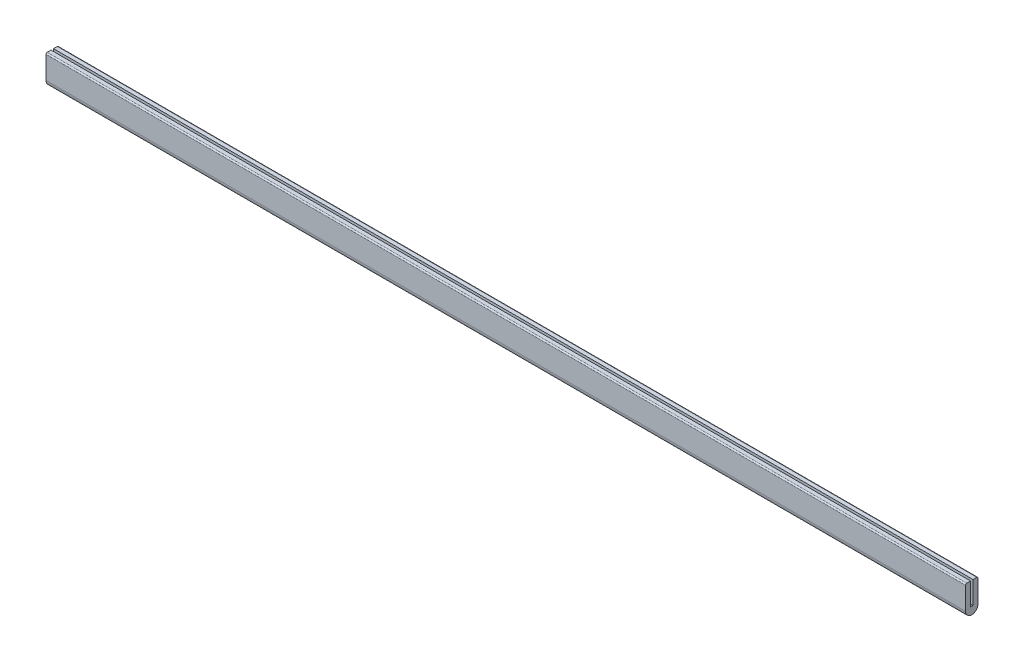
ISO-10303-21;
HEADER;
FILE_DESCRIPTION(('STEP AP214'),'2;1');
FILE_NAME('part.step','',(''),(''),'','','');
FILE_SCHEMA(('AUTOMOTIVE_DESIGN { 1 0 10303 214 1 1 1 1 }'));
ENDSEC;
DATA;
#1=APPLICATION_CONTEXT('core data for automotive mechanical design processes');
#2=APPLICATION_PROTOCOL_DEFINITION('international standard','automotive_design',2000,#1);
#3=PRODUCT_CONTEXT('',#1,'mechanical');
#4=PRODUCT('Part','Part','',(#3));
#5=PRODUCT_RELATED_PRODUCT_CATEGORY('part','',(#4));
#6=PRODUCT_DEFINITION_FORMATION('','',#4);
#7=PRODUCT_DEFINITION_CONTEXT('part definition',#1,'design');
#8=PRODUCT_DEFINITION('design','',#6,#7);
#9=PRODUCT_DEFINITION_SHAPE('','',#8);
#10=(LENGTH_UNIT() NAMED_UNIT(*) SI_UNIT(.MILLI.,.METRE.));
#11=(NAMED_UNIT(*) PLANE_ANGLE_UNIT() SI_UNIT($,.RADIAN.));
#12=(NAMED_UNIT(*) SI_UNIT($,.STERADIAN.) SOLID_ANGLE_UNIT());
#13=UNCERTAINTY_MEASURE_WITH_UNIT(LENGTH_MEASURE(1.E-05),#10,'distance_accuracy_value','');
#14=(GEOMETRIC_REPRESENTATION_CONTEXT(3) GLOBAL_UNCERTAINTY_ASSIGNED_CONTEXT((#13)) GLOBAL_UNIT_ASSIGNED_CONTEXT((#10,
#11,#12)) REPRESENTATION_CONTEXT('',''));
#15=CARTESIAN_POINT('',(0.,0.,0.));
#16=DIRECTION('',(0.,0.,1.));
#17=DIRECTION('',(1.,0.,0.));
#18=AXIS2_PLACEMENT_3D('',#15,#16,#17);
#19=CARTESIAN_POINT('',(584.2,28.575,1.5875));
#20=DIRECTION('',(0.,0.,1.));
#21=DIRECTION('',(0.,-1.,0.));
#22=AXIS2_PLACEMENT_3D('',#19,#20,#21);
#23=PLANE('',#22);
#24=DIRECTION('',(0.,1.,0.));
#25=VECTOR('',#24,1.);
#26=CARTESIAN_POINT('',(-584.2,28.575,1.5875));
#27=LINE('',#26,#25);
#28=CARTESIAN_POINT('',(-584.2,0.,1.5875));
#29=VERTEX_POINT('',#28);
#30=CARTESIAN_POINT('',(-584.2,28.575,1.5875));
#31=VERTEX_POINT('',#30);
#32=EDGE_CURVE('E132',#29,#31,#27,.T.);
#33=ORIENTED_EDGE('',*,*,#32,.T.);
#34=DIRECTION('',(-1.,0.,0.));
#35=VECTOR('',#34,1.);
#36=CARTESIAN_POINT('',(584.2,28.575,1.5875));
#37=LINE('',#36,#35);
#38=CARTESIAN_POINT('',(584.2,28.575,1.5875));
#39=VERTEX_POINT('',#38);
#40=EDGE_CURVE('E114',#39,#31,#37,.T.);
#41=ORIENTED_EDGE('',*,*,#40,.F.);
#42=DIRECTION('',(0.,1.,0.));
#43=VECTOR('',#42,1.);
#44=CARTESIAN_POINT('',(584.2,28.575,1.5875));
#45=LINE('',#44,#43);
#46=CARTESIAN_POINT('',(584.2,0.,1.5875));
#47=VERTEX_POINT('',#46);
#48=EDGE_CURVE('E120',#47,#39,#45,.T.);
#49=ORIENTED_EDGE('',*,*,#48,.F.);
#50=DIRECTION('',(-1.,0.,0.));
#51=VECTOR('',#50,1.);
#52=CARTESIAN_POINT('',(584.2,0.,1.5875));
#53=LINE('',#52,#51);
#54=EDGE_CURVE('E175',#47,#29,#53,.T.);
#55=ORIENTED_EDGE('',*,*,#54,.T.);
#56=EDGE_LOOP('',(#33,#41,#49,#55));
#57=FACE_BOUND('',#56,.T.);
#58=ADVANCED_FACE('F32',(#57),#23,.F.);
#59=CARTESIAN_POINT('',(584.2,28.575,1.5875));
#60=DIRECTION('',(0.,-1.,0.));
#61=DIRECTION('',(0.,0.,-1.));
#62=AXIS2_PLACEMENT_3D('',#59,#60,#61);
#63=PLANE('',#62);
#64=DIRECTION('',(0.,0.,1.));
#65=VECTOR('',#64,1.);
#66=CARTESIAN_POINT('',(-584.2,28.575,1.5875));
#67=LINE('',#66,#65);
#68=CARTESIAN_POINT('',(-584.2,28.575,6.34999999999999));
#69=VERTEX_POINT('',#68);
#70=EDGE_CURVE('E189',#31,#69,#67,.T.);
#71=ORIENTED_EDGE('',*,*,#70,.T.);
#72=DIRECTION('',(-1.,0.,0.));
#73=VECTOR('',#72,1.);
#74=CARTESIAN_POINT('',(584.2,28.575,6.34999999999999));
#75=LINE('',#74,#73);
#76=CARTESIAN_POINT('',(584.2,28.575,6.34999999999999));
#77=VERTEX_POINT('',#76);
#78=EDGE_CURVE('E117',#69,#77,#75,.F.);
#79=ORIENTED_EDGE('',*,*,#78,.T.);
#80=DIRECTION('',(0.,0.,1.));
#81=VECTOR('',#80,1.);
#82=CARTESIAN_POINT('',(584.2,28.575,1.5875));
#83=LINE('',#82,#81);
#84=EDGE_CURVE('E109',#39,#77,#83,.T.);
#85=ORIENTED_EDGE('',*,*,#84,.F.);
#86=ORIENTED_EDGE('',*,*,#40,.T.);
#87=EDGE_LOOP('',(#71,#79,#85,#86));
#88=FACE_BOUND('',#87,.T.);
#89=ADVANCED_FACE('F112',(#88),#63,.F.);
#90=CARTESIAN_POINT('',(584.2,28.575,7.93749999999999));
#91=DIRECTION('',(0.,0.,-1.));
#92=DIRECTION('',(0.,1.,0.));
#93=AXIS2_PLACEMENT_3D('',#90,#91,#92);
#94=PLANE('',#93);
#95=DIRECTION('',(0.,-1.,0.));
#96=VECTOR('',#95,1.);
#97=CARTESIAN_POINT('',(584.2,28.575,7.93749999999999));
#98=LINE('',#97,#96);
#99=CARTESIAN_POINT('',(584.2,26.9875,7.93749999999999));
#100=VERTEX_POINT('',#99);
#101=CARTESIAN_POINT('',(584.2,-1.58750000000001,7.9375));
#102=VERTEX_POINT('',#101);
#103=EDGE_CURVE('E119',#100,#102,#98,.T.);
#104=ORIENTED_EDGE('',*,*,#103,.F.);
#105=DIRECTION('',(-1.,0.,0.));
#106=VECTOR('',#105,1.);
#107=CARTESIAN_POINT('',(584.2,26.9875,7.93749999999999));
#108=LINE('',#107,#106);
#109=CARTESIAN_POINT('',(-584.2,26.9875,7.93749999999999));
#110=VERTEX_POINT('',#109);
#111=EDGE_CURVE('E133',#100,#110,#108,.T.);
#112=ORIENTED_EDGE('',*,*,#111,.T.);
#113=DIRECTION('',(0.,-1.,0.));
#114=VECTOR('',#113,1.);
#115=CARTESIAN_POINT('',(-584.2,28.575,7.93749999999999));
#116=LINE('',#115,#114);
#117=CARTESIAN_POINT('',(-584.2,-1.58750000000001,7.9375));
#118=VERTEX_POINT('',#117);
#119=EDGE_CURVE('E188',#110,#118,#116,.T.);
#120=ORIENTED_EDGE('',*,*,#119,.T.);
#121=DIRECTION('',(-1.,0.,0.));
#122=VECTOR('',#121,1.);
#123=CARTESIAN_POINT('',(584.2,-1.58750000000001,7.9375));
#124=LINE('',#123,#122);
#125=EDGE_CURVE('E134',#102,#118,#124,.T.);
#126=ORIENTED_EDGE('',*,*,#125,.F.);
#127=EDGE_LOOP('',(#104,#112,#120,#126));
#128=FACE_BOUND('',#127,.T.);
#129=ADVANCED_FACE('F205',(#128),#94,.F.);
#130=CARTESIAN_POINT('',(584.2,-1.58750000000001,0.));
#131=DIRECTION('',(-1.,0.,0.));
#132=DIRECTION('',(0.,0.,1.));
#133=AXIS2_PLACEMENT_3D('',#130,#131,#132);
#134=CYLINDRICAL_SURFACE('',#133,7.9375);
#135=CARTESIAN_POINT('',(-584.2,-1.58750000000001,0.));
#136=DIRECTION('',(1.,0.,0.));
#137=DIRECTION('',(0.,0.,1.));
#138=AXIS2_PLACEMENT_3D('',#135,#136,#137);
#139=CIRCLE('',#138,7.9375);
#140=CARTESIAN_POINT('',(-584.2,-1.5875,-7.9375));
#141=VERTEX_POINT('',#140);
#142=EDGE_CURVE('E170',#118,#141,#139,.T.);
#143=ORIENTED_EDGE('',*,*,#142,.T.);
#144=DIRECTION('',(-1.,0.,0.));
#145=VECTOR('',#144,1.);
#146=CARTESIAN_POINT('',(584.2,-1.5875,-7.9375));
#147=LINE('',#146,#145);
#148=CARTESIAN_POINT('',(584.2,-1.5875,-7.9375));
#149=VERTEX_POINT('',#148);
#150=EDGE_CURVE('E140',#149,#141,#147,.T.);
#151=ORIENTED_EDGE('',*,*,#150,.F.);
#152=CARTESIAN_POINT('',(584.2,-1.58750000000001,0.));
#153=DIRECTION('',(1.,0.,0.));
#154=DIRECTION('',(0.,0.,1.));
#155=AXIS2_PLACEMENT_3D('',#152,#153,#154);
#156=CIRCLE('',#155,7.9375);
#157=EDGE_CURVE('E199',#102,#149,#156,.T.);
#158=ORIENTED_EDGE('',*,*,#157,.F.);
#159=ORIENTED_EDGE('',*,*,#125,.T.);
#160=EDGE_LOOP('',(#143,#151,#158,#159));
#161=FACE_BOUND('',#160,.T.);
#162=ADVANCED_FACE('F206',(#161),#134,.T.);
#163=CARTESIAN_POINT('',(584.2,28.575,-7.93749999999999));
#164=DIRECTION('',(0.,0.,1.));
#165=DIRECTION('',(0.,-1.,0.));
#166=AXIS2_PLACEMENT_3D('',#163,#164,#165);
#167=PLANE('',#166);
#168=DIRECTION('',(0.,1.,0.));
#169=VECTOR('',#168,1.);
#170=CARTESIAN_POINT('',(-584.2,28.575,-7.93749999999999));
#171=LINE('',#170,#169);
#172=CARTESIAN_POINT('',(-584.2,26.9875,-7.93749999999999));
#173=VERTEX_POINT('',#172);
#174=EDGE_CURVE('E167',#141,#173,#171,.T.);
#175=ORIENTED_EDGE('',*,*,#174,.T.);
#176=DIRECTION('',(-1.,0.,0.));
#177=VECTOR('',#176,1.);
#178=CARTESIAN_POINT('',(584.2,26.9875,-7.93749999999999));
#179=LINE('',#178,#177);
#180=CARTESIAN_POINT('',(584.2,26.9875,-7.93749999999999));
#181=VERTEX_POINT('',#180);
#182=EDGE_CURVE('E11',#173,#181,#179,.F.);
#183=ORIENTED_EDGE('',*,*,#182,.T.);
#184=DIRECTION('',(0.,1.,0.));
#185=VECTOR('',#184,1.);
#186=CARTESIAN_POINT('',(584.2,28.575,-7.93749999999999));
#187=LINE('',#186,#185);
#188=EDGE_CURVE('E184',#149,#181,#187,.T.);
#189=ORIENTED_EDGE('',*,*,#188,.F.);
#190=ORIENTED_EDGE('',*,*,#150,.T.);
#191=EDGE_LOOP('',(#175,#183,#189,#190));
#192=FACE_BOUND('',#191,.T.);
#193=ADVANCED_FACE('F183',(#192),#167,.F.);
#194=CARTESIAN_POINT('',(584.2,28.575,-7.93749999999999));
#195=DIRECTION('',(0.,-1.,0.));
#196=DIRECTION('',(0.,0.,-1.));
#197=AXIS2_PLACEMENT_3D('',#194,#195,#196);
#198=PLANE('',#197);
#199=DIRECTION('',(0.,0.,1.));
#200=VECTOR('',#199,1.);
#201=CARTESIAN_POINT('',(584.2,28.575,-7.93749999999999));
#202=LINE('',#201,#200);
#203=CARTESIAN_POINT('',(584.2,28.575,-6.34999999999999));
#204=VERTEX_POINT('',#203);
#205=CARTESIAN_POINT('',(584.2,28.575,-1.58749999999999));
#206=VERTEX_POINT('',#205);
#207=EDGE_CURVE('E158',#204,#206,#202,.T.);
#208=ORIENTED_EDGE('',*,*,#207,.F.);
#209=DIRECTION('',(-1.,0.,0.));
#210=VECTOR('',#209,1.);
#211=CARTESIAN_POINT('',(584.2,28.575,-6.34999999999999));
#212=LINE('',#211,#210);
#213=CARTESIAN_POINT('',(-584.2,28.575,-6.34999999999999));
#214=VERTEX_POINT('',#213);
#215=EDGE_CURVE('E40',#204,#214,#212,.T.);
#216=ORIENTED_EDGE('',*,*,#215,.T.);
#217=DIRECTION('',(0.,0.,1.));
#218=VECTOR('',#217,1.);
#219=CARTESIAN_POINT('',(-584.2,28.575,-7.93749999999999));
#220=LINE('',#219,#218);
#221=CARTESIAN_POINT('',(-584.2,28.575,-1.58749999999999));
#222=VERTEX_POINT('',#221);
#223=EDGE_CURVE('E156',#214,#222,#220,.T.);
#224=ORIENTED_EDGE('',*,*,#223,.T.);
#225=DIRECTION('',(-1.,0.,0.));
#226=VECTOR('',#225,1.);
#227=CARTESIAN_POINT('',(584.2,28.575,-1.58749999999999));
#228=LINE('',#227,#226);
#229=EDGE_CURVE('E180',#206,#222,#228,.T.);
#230=ORIENTED_EDGE('',*,*,#229,.F.);
#231=EDGE_LOOP('',(#208,#216,#224,#230));
#232=FACE_BOUND('',#231,.T.);
#233=ADVANCED_FACE('F154',(#232),#198,.F.);
#234=CARTESIAN_POINT('',(584.2,28.575,-1.58749999999999));
#235=DIRECTION('',(0.,0.,-1.));
#236=DIRECTION('',(0.,1.,0.));
#237=AXIS2_PLACEMENT_3D('',#234,#235,#236);
#238=PLANE('',#237);
#239=DIRECTION('',(0.,-1.,0.));
#240=VECTOR('',#239,1.);
#241=CARTESIAN_POINT('',(-584.2,28.575,-1.58749999999999));
#242=LINE('',#241,#240);
#243=CARTESIAN_POINT('',(-584.2,0.,-1.5875));
#244=VERTEX_POINT('',#243);
#245=EDGE_CURVE('E166',#222,#244,#242,.T.);
#246=ORIENTED_EDGE('',*,*,#245,.T.);
#247=DIRECTION('',(-1.,0.,0.));
#248=VECTOR('',#247,1.);
#249=CARTESIAN_POINT('',(584.2,0.,-1.5875));
#250=LINE('',#249,#248);
#251=CARTESIAN_POINT('',(584.2,0.,-1.5875));
#252=VERTEX_POINT('',#251);
#253=EDGE_CURVE('E177',#252,#244,#250,.T.);
#254=ORIENTED_EDGE('',*,*,#253,.F.);
#255=DIRECTION('',(0.,-1.,0.));
#256=VECTOR('',#255,1.);
#257=CARTESIAN_POINT('',(584.2,28.575,-1.58749999999999));
#258=LINE('',#257,#256);
#259=EDGE_CURVE('E195',#206,#252,#258,.T.);
#260=ORIENTED_EDGE('',*,*,#259,.F.);
#261=ORIENTED_EDGE('',*,*,#229,.T.);
#262=EDGE_LOOP('',(#246,#254,#260,#261));
#263=FACE_BOUND('',#262,.T.);
#264=ADVANCED_FACE('F234',(#263),#238,.F.);
#265=CARTESIAN_POINT('',(584.2,0.,1.5875));
#266=DIRECTION('',(0.,-1.,0.));
#267=DIRECTION('',(0.,0.,-1.));
#268=AXIS2_PLACEMENT_3D('',#265,#266,#267);
#269=PLANE('',#268);
#270=DIRECTION('',(0.,0.,1.));
#271=VECTOR('',#270,1.);
#272=CARTESIAN_POINT('',(-584.2,0.,1.5875));
#273=LINE('',#272,#271);
#274=EDGE_CURVE('E129',#244,#29,#273,.T.);
#275=ORIENTED_EDGE('',*,*,#274,.T.);
#276=ORIENTED_EDGE('',*,*,#54,.F.);
#277=DIRECTION('',(0.,0.,1.));
#278=VECTOR('',#277,1.);
#279=CARTESIAN_POINT('',(584.2,0.,1.5875));
#280=LINE('',#279,#278);
#281=EDGE_CURVE('E125',#252,#47,#280,.T.);
#282=ORIENTED_EDGE('',*,*,#281,.F.);
#283=ORIENTED_EDGE('',*,*,#253,.T.);
#284=EDGE_LOOP('',(#275,#276,#282,#283));
#285=FACE_BOUND('',#284,.T.);
#286=ADVANCED_FACE('F230',(#285),#269,.F.);
#287=CARTESIAN_POINT('',(584.2,-1.58750000000001,0.));
#288=DIRECTION('',(-1.,0.,0.));
#289=DIRECTION('',(0.,0.,1.));
#290=AXIS2_PLACEMENT_3D('',#287,#288,#289);
#291=PLANE('',#290);
#292=ORIENTED_EDGE('',*,*,#84,.T.);
#293=CARTESIAN_POINT('',(584.2,26.9875,6.34999999999999));
#294=DIRECTION('',(-1.,0.,0.));
#295=DIRECTION('',(0.,0.,1.));
#296=AXIS2_PLACEMENT_3D('',#293,#294,#295);
#297=CIRCLE('',#296,1.5875);
#298=EDGE_CURVE('E149',#77,#100,#297,.F.);
#299=ORIENTED_EDGE('',*,*,#298,.T.);
#300=ORIENTED_EDGE('',*,*,#103,.T.);
#301=ORIENTED_EDGE('',*,*,#157,.T.);
#302=ORIENTED_EDGE('',*,*,#188,.T.);
#303=CARTESIAN_POINT('',(584.2,26.9875,-6.34999999999999));
#304=DIRECTION('',(-1.,0.,0.));
#305=DIRECTION('',(0.,0.,1.));
#306=AXIS2_PLACEMENT_3D('',#303,#304,#305);
#307=CIRCLE('',#306,1.5875);
#308=EDGE_CURVE('E47',#181,#204,#307,.F.);
#309=ORIENTED_EDGE('',*,*,#308,.T.);
#310=ORIENTED_EDGE('',*,*,#207,.T.);
#311=ORIENTED_EDGE('',*,*,#259,.T.);
#312=ORIENTED_EDGE('',*,*,#281,.T.);
#313=ORIENTED_EDGE('',*,*,#48,.T.);
#314=EDGE_LOOP('',(#292,#299,#300,#301,#302,#309,#310,#311,#312,#313));
#315=FACE_BOUND('',#314,.T.);
#316=ADVANCED_FACE('F123',(#315),#291,.F.);
#317=CARTESIAN_POINT('',(-584.2,-1.58750000000001,0.));
#318=DIRECTION('',(-1.,0.,0.));
#319=DIRECTION('',(0.,0.,1.));
#320=AXIS2_PLACEMENT_3D('',#317,#318,#319);
#321=PLANE('',#320);
#322=ORIENTED_EDGE('',*,*,#119,.F.);
#323=CARTESIAN_POINT('',(-584.2,26.9875,6.34999999999999));
#324=DIRECTION('',(-1.,0.,0.));
#325=DIRECTION('',(0.,0.,1.));
#326=AXIS2_PLACEMENT_3D('',#323,#324,#325);
#327=CIRCLE('',#326,1.5875);
#328=EDGE_CURVE('E145',#110,#69,#327,.T.);
#329=ORIENTED_EDGE('',*,*,#328,.T.);
#330=ORIENTED_EDGE('',*,*,#70,.F.);
#331=ORIENTED_EDGE('',*,*,#32,.F.);
#332=ORIENTED_EDGE('',*,*,#274,.F.);
#333=ORIENTED_EDGE('',*,*,#245,.F.);
#334=ORIENTED_EDGE('',*,*,#223,.F.);
#335=CARTESIAN_POINT('',(-584.2,26.9875,-6.34999999999999));
#336=DIRECTION('',(-1.,0.,0.));
#337=DIRECTION('',(0.,0.,1.));
#338=AXIS2_PLACEMENT_3D('',#335,#336,#337);
#339=CIRCLE('',#338,1.5875);
#340=EDGE_CURVE('E137',#214,#173,#339,.T.);
#341=ORIENTED_EDGE('',*,*,#340,.T.);
#342=ORIENTED_EDGE('',*,*,#174,.F.);
#343=ORIENTED_EDGE('',*,*,#142,.F.);
#344=EDGE_LOOP('',(#322,#329,#330,#331,#332,#333,#334,#341,#342,#343));
#345=FACE_BOUND('',#344,.T.);
#346=ADVANCED_FACE('F163',(#345),#321,.T.);
#347=CARTESIAN_POINT('',(584.2,26.9875,6.34999999999999));
#348=DIRECTION('',(-1.,0.,0.));
#349=DIRECTION('',(0.,0.,1.));
#350=AXIS2_PLACEMENT_3D('',#347,#348,#349);
#351=CYLINDRICAL_SURFACE('',#350,1.5875);
#352=ORIENTED_EDGE('',*,*,#298,.F.);
#353=ORIENTED_EDGE('',*,*,#78,.F.);
#354=ORIENTED_EDGE('',*,*,#328,.F.);
#355=ORIENTED_EDGE('',*,*,#111,.F.);
#356=EDGE_LOOP('',(#352,#353,#354,#355));
#357=FACE_BOUND('',#356,.T.);
#358=ADVANCED_FACE('F221',(#357),#351,.T.);
#359=CARTESIAN_POINT('',(584.2,26.9875,-6.34999999999999));
#360=DIRECTION('',(-1.,0.,0.));
#361=DIRECTION('',(0.,0.,1.));
#362=AXIS2_PLACEMENT_3D('',#359,#360,#361);
#363=CYLINDRICAL_SURFACE('',#362,1.5875);
#364=ORIENTED_EDGE('',*,*,#308,.F.);
#365=ORIENTED_EDGE('',*,*,#182,.F.);
#366=ORIENTED_EDGE('',*,*,#340,.F.);
#367=ORIENTED_EDGE('',*,*,#215,.F.);
#368=EDGE_LOOP('',(#364,#365,#366,#367));
#369=FACE_BOUND('',#368,.T.);
#370=ADVANCED_FACE('F34',(#369),#363,.T.);
#371=CLOSED_SHELL('',(#58,#89,#129,#162,#193,#233,#264,#286,#316,#346,#358,#370));
#372=MANIFOLD_SOLID_BREP('B2',#371);
#373=ADVANCED_BREP_SHAPE_REPRESENTATION('',(#18,#372),#14);
#374=SHAPE_DEFINITION_REPRESENTATION(#9,#373);
ENDSEC;
END-ISO-10303-21;
